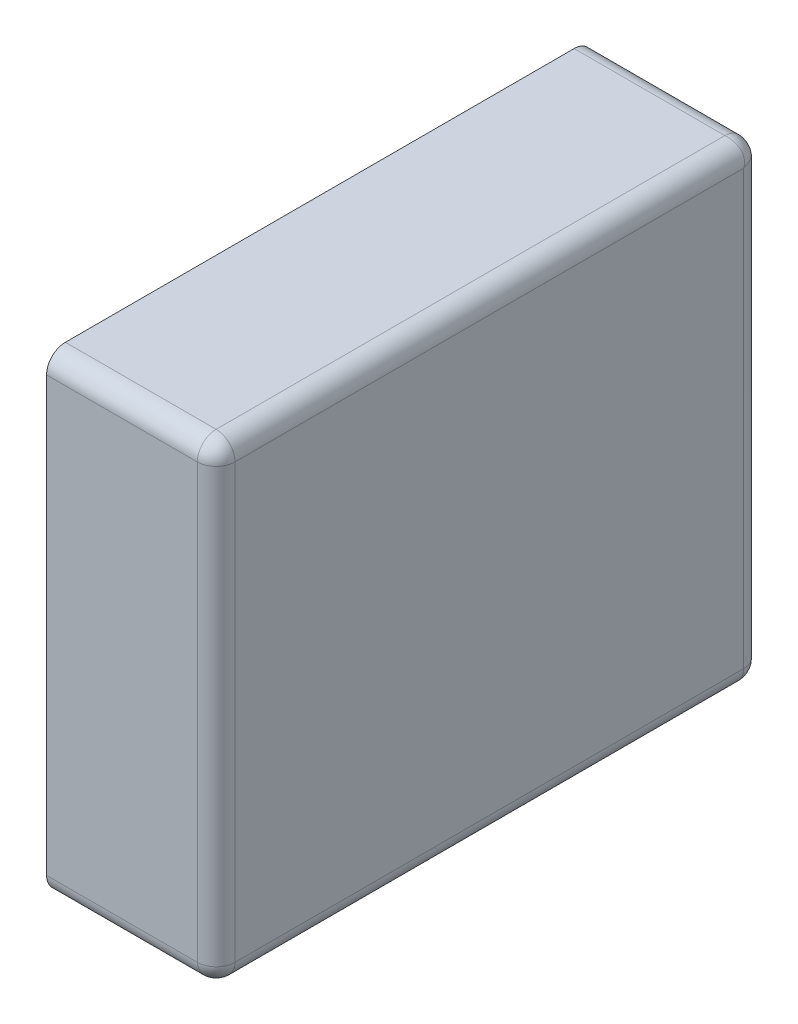
ISO-10303-21;
HEADER;
FILE_DESCRIPTION(('STEP AP214'),'2;1');
FILE_NAME('part.step','',(''),(''),'','','');
FILE_SCHEMA(('AUTOMOTIVE_DESIGN { 1 0 10303 214 1 1 1 1 }'));
ENDSEC;
DATA;
#1=APPLICATION_CONTEXT('core data for automotive mechanical design processes');
#2=APPLICATION_PROTOCOL_DEFINITION('international standard','automotive_design',2000,#1);
#3=PRODUCT_CONTEXT('',#1,'mechanical');
#4=PRODUCT('Part','Part','',(#3));
#5=PRODUCT_RELATED_PRODUCT_CATEGORY('part','',(#4));
#6=PRODUCT_DEFINITION_FORMATION('','',#4);
#7=PRODUCT_DEFINITION_CONTEXT('part definition',#1,'design');
#8=PRODUCT_DEFINITION('design','',#6,#7);
#9=PRODUCT_DEFINITION_SHAPE('','',#8);
#10=(LENGTH_UNIT() NAMED_UNIT(*) SI_UNIT(.MILLI.,.METRE.));
#11=(NAMED_UNIT(*) PLANE_ANGLE_UNIT() SI_UNIT($,.RADIAN.));
#12=(NAMED_UNIT(*) SI_UNIT($,.STERADIAN.) SOLID_ANGLE_UNIT());
#13=UNCERTAINTY_MEASURE_WITH_UNIT(LENGTH_MEASURE(1.E-05),#10,'distance_accuracy_value','');
#14=(GEOMETRIC_REPRESENTATION_CONTEXT(3) GLOBAL_UNCERTAINTY_ASSIGNED_CONTEXT((#13)) GLOBAL_UNIT_ASSIGNED_CONTEXT((#10,
#11,#12)) REPRESENTATION_CONTEXT('',''));
#15=CARTESIAN_POINT('',(0.,0.,0.));
#16=DIRECTION('',(0.,0.,1.));
#17=DIRECTION('',(1.,0.,0.));
#18=AXIS2_PLACEMENT_3D('',#15,#16,#17);
#19=CARTESIAN_POINT('',(0.25,-0.308333310554192,0.05));
#20=DIRECTION('',(-0.408248290463863,-0.816496580927726,0.408248290463863));
#21=DIRECTION('',(0.577350269189626,-0.577350269189626,-0.577350269189626));
#22=AXIS2_PLACEMENT_3D('',#19,#20,#21);
#23=SPHERICAL_SURFACE('',#22,0.05);
#24=CARTESIAN_POINT('',(0.25,-0.308333310554192,0.05));
#25=DIRECTION('',(1.,0.,0.));
#26=DIRECTION('',(0.,0.,-1.));
#27=AXIS2_PLACEMENT_3D('',#24,#25,#26);
#28=CIRCLE('',#27,0.05);
#29=CARTESIAN_POINT('',(0.25,-0.358333310554192,0.05));
#30=VERTEX_POINT('',#29);
#31=CARTESIAN_POINT('',(0.25,-0.308333310554192,0.));
#32=VERTEX_POINT('',#31);
#33=EDGE_CURVE('E11',#30,#32,#28,.T.);
#34=ORIENTED_EDGE('',*,*,#33,.T.);
#35=CARTESIAN_POINT('',(0.25,-0.308333310554192,0.05));
#36=DIRECTION('',(0.,-1.,0.));
#37=DIRECTION('',(1.,0.,0.));
#38=AXIS2_PLACEMENT_3D('',#35,#36,#37);
#39=CIRCLE('',#38,0.05);
#40=CARTESIAN_POINT('',(0.3,-0.308333310554192,0.05));
#41=VERTEX_POINT('',#40);
#42=EDGE_CURVE('E24',#32,#41,#39,.T.);
#43=ORIENTED_EDGE('',*,*,#42,.T.);
#44=CARTESIAN_POINT('',(0.25,-0.308333310554192,0.05));
#45=DIRECTION('',(0.,0.,-1.));
#46=DIRECTION('',(0.,-1.,0.));
#47=AXIS2_PLACEMENT_3D('',#44,#45,#46);
#48=CIRCLE('',#47,0.05);
#49=EDGE_CURVE('E287',#41,#30,#48,.T.);
#50=ORIENTED_EDGE('',*,*,#49,.T.);
#51=EDGE_LOOP('',(#34,#43,#50));
#52=FACE_BOUND('',#51,.T.);
#53=ADVANCED_FACE('F17',(#52),#23,.T.);
#54=CARTESIAN_POINT('',(0.25,-0.308333310554192,1.4));
#55=DIRECTION('',(-0.408248290463862,-0.816496580927726,-0.408248290463864));
#56=DIRECTION('',(0.577350269189625,-0.577350269189626,0.577350269189627));
#57=AXIS2_PLACEMENT_3D('',#54,#55,#56);
#58=SPHERICAL_SURFACE('',#57,0.05);
#59=CARTESIAN_POINT('',(0.25,-0.308333310554192,1.45));
#60=CARTESIAN_POINT('',(0.250056476640882,-0.309164662981859,1.45000002031397));
#61=CARTESIAN_POINT('',(0.250121168311557,-0.30999542167902,1.44997917131755));
#62=CARTESIAN_POINT('',(0.250265391195623,-0.311657334802944,1.44989569556504));
#63=CARTESIAN_POINT('',(0.250344988001439,-0.31248847412573,1.44983288086806));
#64=CARTESIAN_POINT('',(0.250517234671643,-0.314148546660269,1.44966509757926));
#65=CARTESIAN_POINT('',(0.250609936033336,-0.314977457349145,1.44955995950256));
#66=CARTESIAN_POINT('',(0.250806520816706,-0.316630527199554,1.44930737239836));
#67=CARTESIAN_POINT('',(0.25091044290025,-0.317454658911413,1.44915977396341));
#68=CARTESIAN_POINT('',(0.251127528752862,-0.319095657803344,1.44882229239235));
#69=CARTESIAN_POINT('',(0.251240719867609,-0.319912494981017,1.44863228105857));
#70=CARTESIAN_POINT('',(0.251474344176626,-0.321536442570935,1.44821019528102));
#71=CARTESIAN_POINT('',(0.251594795122853,-0.322343522825329,1.44797801468437));
#72=CARTESIAN_POINT('',(0.251840892195576,-0.323945551721639,1.44747200526275));
#73=CARTESIAN_POINT('',(0.251966548375925,-0.324740472397371,1.44719809281404));
#74=CARTESIAN_POINT('',(0.252220973549074,-0.32631584408808,1.44660922840147));
#75=CARTESIAN_POINT('',(0.252349746928956,-0.327096271606362,1.44629421548598));
#76=CARTESIAN_POINT('',(0.252608300810853,-0.328640393971993,1.44562395131688));
#77=CARTESIAN_POINT('',(0.252738082163722,-0.329404071972065,1.44526866158421));
#78=CARTESIAN_POINT('',(0.252996535248399,-0.330912515415975,1.44451883535746));
#79=CARTESIAN_POINT('',(0.253125206487437,-0.331657272720296,1.44412428231988));
#80=CARTESIAN_POINT('',(0.253379323912972,-0.333125785626233,1.44329710837936));
#81=CARTESIAN_POINT('',(0.253504770480528,-0.333849543710642,1.44286449200134));
#82=CARTESIAN_POINT('',(0.253750336828149,-0.335274066953656,1.44196255359726));
#83=CARTESIAN_POINT('',(0.253870460068205,-0.335974846967864,1.44149325597784));
#84=CARTESIAN_POINT('',(0.254103304064891,-0.337351527474695,1.44051949570568));
#85=CARTESIAN_POINT('',(0.254216033516177,-0.338027456763577,1.44001507584848));
#86=CARTESIAN_POINT('',(0.254432052512974,-0.33935266005221,1.43897278428959));
#87=CARTESIAN_POINT('',(0.254535358057478,-0.340001978156978,1.43843497199004));
#88=CARTESIAN_POINT('',(0.254730542154479,-0.341272299809228,1.43732777460933));
#89=CARTESIAN_POINT('',(0.254822445957708,-0.341893363923171,1.43675846348493));
#90=CARTESIAN_POINT('',(0.254992901649071,-0.343105639944394,1.43559030584348));
#91=CARTESIAN_POINT('',(0.255071489829275,-0.343696929802492,1.43499154553938));
#92=CARTESIAN_POINT('',(0.255213463043959,-0.344848245829343,1.43376667689025));
#93=CARTESIAN_POINT('',(0.255276897009026,-0.345408368013381,1.43314066449634));
#94=CARTESIAN_POINT('',(0.255386795425953,-0.346496067335968,1.43186361983902));
#95=CARTESIAN_POINT('',(0.255433322818258,-0.347023758979868,1.43121269055809));
#96=CARTESIAN_POINT('',(0.255507737338678,-0.348045449350346,1.42988827123633));
#97=CARTESIAN_POINT('',(0.25553570253075,-0.348539581233155,1.42921488834858));
#98=CARTESIAN_POINT('',(0.255571427793508,-0.349493140439531,1.42784814127885));
#99=CARTESIAN_POINT('',(0.255579281877824,-0.349952719457549,1.42715488544524));
#100=CARTESIAN_POINT('',(0.255573335713261,-0.350836299644668,1.42575108108726));
#101=CARTESIAN_POINT('',(0.255559645939103,-0.351260470653455,1.42504063906048));
#102=CARTESIAN_POINT('',(0.255509287643763,-0.352072501389798,1.42360524818424));
#103=CARTESIAN_POINT('',(0.255472746231199,-0.352460548424196,1.42288040091383));
#104=CARTESIAN_POINT('',(0.255375493621831,-0.353199738480209,1.42141907045753));
#105=CARTESIAN_POINT('',(0.255314925981525,-0.35355108531067,1.42068268089524));
#106=CARTESIAN_POINT('',(0.255168570932992,-0.354216423264989,1.41920120834795));
#107=CARTESIAN_POINT('',(0.255082942970717,-0.354530633447628,1.41845620808787));
#108=CARTESIAN_POINT('',(0.254885566112575,-0.355121386709123,1.41696051703845));
#109=CARTESIAN_POINT('',(0.254773991607376,-0.355398162565069,1.41620989527186));
#110=CARTESIAN_POINT('',(0.254523973299393,-0.355913876381134,1.41470600292695));
#111=CARTESIAN_POINT('',(0.254385717519098,-0.356153059023342,1.4139527851382));
#112=CARTESIAN_POINT('',(0.254081755398417,-0.356593549745939,1.41244679638543));
#113=CARTESIAN_POINT('',(0.253916248962334,-0.356795112374401,1.41169405953744));
#114=CARTESIAN_POINT('',(0.253557343726359,-0.357160476248509,1.41019206042752));
#115=CARTESIAN_POINT('',(0.253364154831346,-0.357324539502694,1.40944281229227));
#116=CARTESIAN_POINT('',(0.253052732369609,-0.357542869289562,1.4083219455075));
#117=CARTESIAN_POINT('',(0.252945638881777,-0.357610870709135,1.40794983260432));
#118=CARTESIAN_POINT('',(0.252724431166697,-0.357737569445092,1.40720763742837));
#119=CARTESIAN_POINT('',(0.252610344441124,-0.357796300321971,1.40683755274195));
#120=CARTESIAN_POINT('',(0.252375149481327,-0.35790450391496,1.40609981269566));
#121=CARTESIAN_POINT('',(0.252254068989278,-0.357954010307306,1.40573215342186));
#122=CARTESIAN_POINT('',(0.25200489200401,-0.358043823540288,1.40499964182244));
#123=CARTESIAN_POINT('',(0.251876823418455,-0.358084164066007,1.40463478414168));
#124=CARTESIAN_POINT('',(0.25161368768569,-0.358155710450416,1.4039082563057));
#125=CARTESIAN_POINT('',(0.251478648512781,-0.358186949917715,1.40354657933213));
#126=CARTESIAN_POINT('',(0.251201599789781,-0.358240367053443,1.40282678964261));
#127=CARTESIAN_POINT('',(0.251059618183824,-0.358262578160602,1.40246866865684));
#128=CARTESIAN_POINT('',(0.250768722771826,-0.358298018075102,1.40175636445159));
#129=CARTESIAN_POINT('',(0.250619836783965,-0.35831128006162,1.40140217152902));
#130=CARTESIAN_POINT('',(0.250315184973883,-0.35832891062971,1.40069809533217));
#131=CARTESIAN_POINT('',(0.25015944673132,-0.358333312030094,1.40034820094293));
#132=CARTESIAN_POINT('',(0.25,-0.358333310554192,1.4));
#133=B_SPLINE_CURVE_WITH_KNOTS('',3,(#59,#60,#61,#62,#63,#64,#65,#66,#67,#68,#69,#70,#71,#72,
#73,#74,#75,#76,#77,#78,#79,#80,#81,#82,#83,#84,#85,#86,#87,#88,#89,#90,#91,#92,#93,#94,#95,#96,
#97,#98,#99,#100,#101,#102,#103,#104,#105,#106,#107,#108,#109,#110,#111,#112,#113,#114,#115,
#116,#117,#118,#119,#120,#121,#122,#123,#124,#125,#126,#127,#128,#129,#130,#131,#132),
.UNSPECIFIED.,.F.,.F.,(4,2,2,2,2,2,2,2,2,2,2,2,2,2,2,2,2,2,2,2,2,2,2,2,2,2,2,2,2,2,2,2,2,2,2,2,
4),(0.,0.00249945349828853,0.00501017636236172,0.00753105510997409,0.0100609150362242,
0.0125985278601288,0.015142619470862,0.017691877752768,0.020244960471291,0.0228005032044077,
0.025357127306039,0.0279134478892866,0.030468081818201,0.0330196556971654,0.0355668138468769,
0.0381082262553105,0.0406425964909796,0.0431686695642027,0.0456852397199663,0.048191158143267,
0.0506853405545279,0.0531667746687543,0.0556345274875088,0.0580877523875284,0.0605256959638786,
0.0629477045789644,0.0653532305615734,0.0677418379925144,0.0701132080055178,0.0712924926926686,
0.0724674051483097,0.0736379404537152,0.0748041017706805,0.0759659004268235,0.0771233559869032,
0.0782764963093342,0.0794253575870824),.UNSPECIFIED.);
#134=CARTESIAN_POINT('',(0.25,-0.308333310554192,1.45));
#135=VERTEX_POINT('',#134);
#136=CARTESIAN_POINT('',(0.25,-0.358333310554192,1.4));
#137=VERTEX_POINT('',#136);
#138=EDGE_CURVE('E285',#135,#137,#133,.T.);
#139=ORIENTED_EDGE('',*,*,#138,.T.);
#140=CARTESIAN_POINT('',(0.25,-0.308333310554192,1.4));
#141=DIRECTION('',(0.,0.,1.));
#142=DIRECTION('',(1.,0.,0.));
#143=AXIS2_PLACEMENT_3D('',#140,#141,#142);
#144=CIRCLE('',#143,0.05);
#145=CARTESIAN_POINT('',(0.3,-0.308333310554192,1.4));
#146=VERTEX_POINT('',#145);
#147=EDGE_CURVE('E321',#137,#146,#144,.T.);
#148=ORIENTED_EDGE('',*,*,#147,.T.);
#149=CARTESIAN_POINT('',(0.25,-0.308333310554192,1.4));
#150=DIRECTION('',(0.,-1.,0.));
#151=DIRECTION('',(0.,0.,1.));
#152=AXIS2_PLACEMENT_3D('',#149,#150,#151);
#153=CIRCLE('',#152,0.05);
#154=EDGE_CURVE('E319',#146,#135,#153,.T.);
#155=ORIENTED_EDGE('',*,*,#154,.T.);
#156=EDGE_LOOP('',(#139,#148,#155));
#157=FACE_BOUND('',#156,.T.);
#158=ADVANCED_FACE('F262',(#157),#58,.T.);
#159=CARTESIAN_POINT('',(0.25,-0.308333310554192,0.));
#160=DIRECTION('',(0.,0.,1.));
#161=DIRECTION('',(0.707106781186548,-0.707106781186547,0.));
#162=AXIS2_PLACEMENT_3D('',#159,#160,#161);
#163=CYLINDRICAL_SURFACE('',#162,0.05);
#164=ORIENTED_EDGE('',*,*,#147,.F.);
#165=DIRECTION('',(0.,0.,-1.));
#166=VECTOR('',#165,1.);
#167=CARTESIAN_POINT('',(0.25,-0.358333310554192,0.));
#168=LINE('',#167,#166);
#169=EDGE_CURVE('E295',#137,#30,#168,.T.);
#170=ORIENTED_EDGE('',*,*,#169,.T.);
#171=ORIENTED_EDGE('',*,*,#49,.F.);
#172=DIRECTION('',(0.,0.,1.));
#173=VECTOR('',#172,1.);
#174=CARTESIAN_POINT('',(0.3,-0.308333310554192,0.));
#175=LINE('',#174,#173);
#176=EDGE_CURVE('E293',#41,#146,#175,.T.);
#177=ORIENTED_EDGE('',*,*,#176,.T.);
#178=EDGE_LOOP('',(#164,#170,#171,#177));
#179=FACE_BOUND('',#178,.T.);
#180=ADVANCED_FACE('F214',(#179),#163,.T.);
#181=CARTESIAN_POINT('',(0.25,0.841666689445808,0.05));
#182=DIRECTION('',(-0.816496580927726,0.408248290463864,-0.408248290463863));
#183=DIRECTION('',(0.577350269189626,0.577350269189626,-0.577350269189625));
#184=AXIS2_PLACEMENT_3D('',#181,#182,#183);
#185=SPHERICAL_SURFACE('',#184,0.05);
#186=CARTESIAN_POINT('',(0.3,0.841666689445808,0.05));
#187=CARTESIAN_POINT('',(0.300000001475902,0.841826136177128,0.0496517990570679));
#188=CARTESIAN_POINT('',(0.299995600075518,0.841981874419691,0.0493019046678338));
#189=CARTESIAN_POINT('',(0.299977969507428,0.842286526229773,0.048597828470979));
#190=CARTESIAN_POINT('',(0.29996470752091,0.842435412217634,0.0482436355484064));
#191=CARTESIAN_POINT('',(0.29992926760641,0.842726307629632,0.0475313313431616));
#192=CARTESIAN_POINT('',(0.299907056499251,0.842868289235589,0.04717321035739));
#193=CARTESIAN_POINT('',(0.299853639363523,0.843145337958589,0.0464534206678749));
#194=CARTESIAN_POINT('',(0.299822399896224,0.843280377131498,0.0460917436943033));
#195=CARTESIAN_POINT('',(0.299750853511815,0.843543512864263,0.0453652158583165));
#196=CARTESIAN_POINT('',(0.299710512986096,0.843671581449818,0.0450003581775609));
#197=CARTESIAN_POINT('',(0.299620699753114,0.843920758435086,0.0442678465781355));
#198=CARTESIAN_POINT('',(0.299571193360768,0.844041838927135,0.0439001873043394));
#199=CARTESIAN_POINT('',(0.299462989767779,0.844277033886932,0.0431624472580473));
#200=CARTESIAN_POINT('',(0.2994042588909,0.844391120612505,0.0427923625716342));
#201=CARTESIAN_POINT('',(0.299277560154943,0.844612328327585,0.0420501673956815));
#202=CARTESIAN_POINT('',(0.29920955873537,0.844719421815417,0.0416780544924992));
#203=CARTESIAN_POINT('',(0.298991228948502,0.845030844277154,0.0405571877077269));
#204=CARTESIAN_POINT('',(0.298827165694317,0.845224033172167,0.0398079395724777));
#205=CARTESIAN_POINT('',(0.298461801820209,0.845582938408142,0.0383059404625556));
#206=CARTESIAN_POINT('',(0.298260239191747,0.845748444844225,0.037553203614566));
#207=CARTESIAN_POINT('',(0.29781974846915,0.846052406964906,0.0360472148618045));
#208=CARTESIAN_POINT('',(0.297580565826942,0.846190662745201,0.0352939970730491));
#209=CARTESIAN_POINT('',(0.297064852010877,0.846440681053184,0.0337901047281378));
#210=CARTESIAN_POINT('',(0.296788076154931,0.846552255558383,0.0330394829615458));
#211=CARTESIAN_POINT('',(0.296197322893436,0.846749632416525,0.0315437919121317));
#212=CARTESIAN_POINT('',(0.295883112710797,0.8468352603788,0.0307987916520525));
#213=CARTESIAN_POINT('',(0.295217774756478,0.846981615427334,0.0293173191047622));
#214=CARTESIAN_POINT('',(0.294866427926017,0.847042183067639,0.0285809295424739));
#215=CARTESIAN_POINT('',(0.294127237870004,0.847139435677007,0.0271195990861678));
#216=CARTESIAN_POINT('',(0.293739190835606,0.847175977089571,0.0263947518157568));
#217=CARTESIAN_POINT('',(0.292927160099263,0.847226335384911,0.0249593609395231));
#218=CARTESIAN_POINT('',(0.292502989090476,0.847240025159069,0.0242489189127446));
#219=CARTESIAN_POINT('',(0.291619408903357,0.847245971323631,0.022845114554765));
#220=CARTESIAN_POINT('',(0.291159829885339,0.847238117239316,0.0221518587211452));
#221=CARTESIAN_POINT('',(0.290206270678963,0.847202391976558,0.0207851116514152));
#222=CARTESIAN_POINT('',(0.289712138796154,0.847174426784487,0.0201117287636731));
#223=CARTESIAN_POINT('',(0.288690448425676,0.847100012264066,0.018787309441907));
#224=CARTESIAN_POINT('',(0.288162756781776,0.847053484871761,0.0181363801609791));
#225=CARTESIAN_POINT('',(0.287075057459189,0.846943586454834,0.0168593355036592));
#226=CARTESIAN_POINT('',(0.286514935275151,0.846880152489767,0.0162333231097527));
#227=CARTESIAN_POINT('',(0.2853636192483,0.846738179275083,0.0150084544606196));
#228=CARTESIAN_POINT('',(0.284772329390202,0.846659591094879,0.0144096941565242));
#229=CARTESIAN_POINT('',(0.283560053368979,0.846489135403516,0.0132415365150735));
#230=CARTESIAN_POINT('',(0.282938989255036,0.846397231600287,0.0126722253906709));
#231=CARTESIAN_POINT('',(0.281668667602786,0.846202047503286,0.0115650280099562));
#232=CARTESIAN_POINT('',(0.281019349498018,0.846098741958783,0.0110272157104117));
#233=CARTESIAN_POINT('',(0.279694146209385,0.845882722961985,0.00998492415151916));
#234=CARTESIAN_POINT('',(0.279018216920503,0.845769993510699,0.00948050429432074));
#235=CARTESIAN_POINT('',(0.277641536413672,0.845537149514013,0.00850674402215685));
#236=CARTESIAN_POINT('',(0.276940756399464,0.845417026273957,0.00803744640273572));
#237=CARTESIAN_POINT('',(0.27551623315645,0.845171459926336,0.00713550799866328));
#238=CARTESIAN_POINT('',(0.274792475072041,0.84504601335878,0.00670289162064473));
#239=CARTESIAN_POINT('',(0.273323962166104,0.844791895933245,0.0058757176801218));
#240=CARTESIAN_POINT('',(0.272579204861783,0.844663224694207,0.00548116464253525));
#241=CARTESIAN_POINT('',(0.271070761417873,0.84440477160953,0.00473133841578786));
#242=CARTESIAN_POINT('',(0.270307083417801,0.844274990256661,0.0043760486831198));
#243=CARTESIAN_POINT('',(0.26876296105217,0.844016436374764,0.00370578451402039));
#244=CARTESIAN_POINT('',(0.267982533533888,0.843887662994882,0.00339077159853355));
#245=CARTESIAN_POINT('',(0.266407161843179,0.843633237821733,0.00280190718596448));
#246=CARTESIAN_POINT('',(0.265612241167447,0.843507581641384,0.00252799473724833));
#247=CARTESIAN_POINT('',(0.264010212271137,0.843261484568661,0.00202198531563092));
#248=CARTESIAN_POINT('',(0.263203132016743,0.843141033622434,0.00178980471897604));
#249=CARTESIAN_POINT('',(0.261579184426824,0.842907409313417,0.00136771894143312));
#250=CARTESIAN_POINT('',(0.260762347249152,0.84279421819867,0.00117770760765169));
#251=CARTESIAN_POINT('',(0.259121348357221,0.842577132346058,0.000840226036591075));
#252=CARTESIAN_POINT('',(0.258297216645363,0.842473210262514,0.000692627601644528));
#253=CARTESIAN_POINT('',(0.256644146794953,0.842276625479144,0.000440040497442487));
#254=CARTESIAN_POINT('',(0.255815236106077,0.842183924117451,0.000334902420738301));
#255=CARTESIAN_POINT('',(0.254155163571538,0.842011677447247,0.000167119131942064));
#256=CARTESIAN_POINT('',(0.253324024248752,0.841932080641431,0.000104304434962564));
#257=CARTESIAN_POINT('',(0.251662111124828,0.841787857757365,2.08286824513665E-05));
#258=CARTESIAN_POINT('',(0.250831352427667,0.84172316608669,-2.0313966927504E-08));
#259=CARTESIAN_POINT('',(0.25,0.841666689445808,0.));
#260=B_SPLINE_CURVE_WITH_KNOTS('',3,(#186,#187,#188,#189,#190,#191,#192,#193,#194,#195,#196,
#197,#198,#199,#200,#201,#202,#203,#204,#205,#206,#207,#208,#209,#210,#211,#212,#213,#214,#215,
#216,#217,#218,#219,#220,#221,#222,#223,#224,#225,#226,#227,#228,#229,#230,#231,#232,#233,#234,
#235,#236,#237,#238,#239,#240,#241,#242,#243,#244,#245,#246,#247,#248,#249,#250,#251,#252,#253,
#254,#255,#256,#257,#258,#259),.UNSPECIFIED.,.F.,.F.,(4,2,2,2,2,2,2,2,2,2,2,2,2,2,2,2,2,2,2,2,2,
2,2,2,2,2,2,2,2,2,2,2,2,2,2,2,4),(0.,0.00114886127774819,0.00230200160017933,
0.00345945716025893,0.00462125581640201,0.00578741713336717,0.00695795243877276,
0.00813286489441385,0.00931214958156474,0.0116835195945681,0.0140721270255091,
0.0164776530081181,0.0188996616232039,0.021337605199554,0.0237908300995737,0.0262585829183281,
0.0287400170325546,0.0312341994438155,0.0337401178671161,0.0362566880228797,0.0387827610961029,
0.0413171313317719,0.0438585437402056,0.046405701889917,0.0489572757688815,0.0515119096977957,
0.0540682302810433,0.0566248543826747,0.0591803971157914,0.0617334798343145,0.0642827381162205,
0.0668268297269537,0.0693644425508582,0.0718943024771082,0.0744151812247206,0.0769259040887938,
0.0794253575870824),.UNSPECIFIED.);
#261=CARTESIAN_POINT('',(0.3,0.841666689445808,0.05));
#262=VERTEX_POINT('',#261);
#263=CARTESIAN_POINT('',(0.25,0.841666689445808,0.));
#264=VERTEX_POINT('',#263);
#265=EDGE_CURVE('E236',#262,#264,#260,.T.);
#266=ORIENTED_EDGE('',*,*,#265,.T.);
#267=CARTESIAN_POINT('',(0.25,0.841666689445808,0.05));
#268=DIRECTION('',(1.,0.,0.));
#269=DIRECTION('',(0.,1.,0.));
#270=AXIS2_PLACEMENT_3D('',#267,#268,#269);
#271=CIRCLE('',#270,0.05);
#272=CARTESIAN_POINT('',(0.25,0.891666689445808,0.05));
#273=VERTEX_POINT('',#272);
#274=EDGE_CURVE('E234',#264,#273,#271,.T.);
#275=ORIENTED_EDGE('',*,*,#274,.T.);
#276=CARTESIAN_POINT('',(0.25,0.891666689445808,0.05));
#277=CARTESIAN_POINT('',(0.250831352427667,0.891666709759775,0.0499435233591183));
#278=CARTESIAN_POINT('',(0.251662111124828,0.891645860763357,0.0498788316884433));
#279=CARTESIAN_POINT('',(0.253324024248752,0.891562385010845,0.049734608804377));
#280=CARTESIAN_POINT('',(0.254155163571538,0.891499570313866,0.0496550119985609));
#281=CARTESIAN_POINT('',(0.255815236106077,0.89133178702507,0.0494827653283566));
#282=CARTESIAN_POINT('',(0.256644146794953,0.891226648948365,0.0493900639666642));
#283=CARTESIAN_POINT('',(0.258297216645363,0.890974061844164,0.0491934791832936));
#284=CARTESIAN_POINT('',(0.259121348357221,0.890826463409217,0.0490895570997497));
#285=CARTESIAN_POINT('',(0.260762347249152,0.890488981838156,0.0488724712471381));
#286=CARTESIAN_POINT('',(0.261579184426824,0.890298970504375,0.0487592801323913));
#287=CARTESIAN_POINT('',(0.263203132016743,0.889876884726832,0.0485256558233742));
#288=CARTESIAN_POINT('',(0.264010212271137,0.889644704130177,0.0484052048771467));
#289=CARTESIAN_POINT('',(0.265612241167447,0.88913869470856,0.0481591078044245));
#290=CARTESIAN_POINT('',(0.266407161843179,0.888864782259843,0.0480334516240748));
#291=CARTESIAN_POINT('',(0.267982533533888,0.888275917847274,0.0477790264509255));
#292=CARTESIAN_POINT('',(0.26876296105217,0.887960904931788,0.0476502530710441));
#293=CARTESIAN_POINT('',(0.270307083417801,0.887290640762688,0.0473916991891467));
#294=CARTESIAN_POINT('',(0.271070761417873,0.88693535103002,0.0472619178362776));
#295=CARTESIAN_POINT('',(0.272579204861783,0.886185524803273,0.0470034647516007));
#296=CARTESIAN_POINT('',(0.273323962166104,0.885790971765686,0.0468747935125628));
#297=CARTESIAN_POINT('',(0.274792475072041,0.884963797825163,0.0466206760870283));
#298=CARTESIAN_POINT('',(0.27551623315645,0.884531181447145,0.046495229519472));
#299=CARTESIAN_POINT('',(0.276940756399464,0.883629243043072,0.0462496631718509));
#300=CARTESIAN_POINT('',(0.277641536413672,0.883159945423651,0.0461295399317952));
#301=CARTESIAN_POINT('',(0.279018216920503,0.882186185151487,0.045896695935109));
#302=CARTESIAN_POINT('',(0.279694146209385,0.881681765294289,0.0457839664838229));
#303=CARTESIAN_POINT('',(0.281019349498018,0.880639473735396,0.0455679474870255));
#304=CARTESIAN_POINT('',(0.281668667602786,0.880101661435852,0.0454646419425221));
#305=CARTESIAN_POINT('',(0.282938989255036,0.878994464055137,0.0452694578455207));
#306=CARTESIAN_POINT('',(0.283560053368979,0.878425152930734,0.0451775540422924));
#307=CARTESIAN_POINT('',(0.284772329390202,0.877256995289284,0.0450070983509292));
#308=CARTESIAN_POINT('',(0.2853636192483,0.876658234985188,0.044928510170725));
#309=CARTESIAN_POINT('',(0.286514935275151,0.875433366336055,0.0447865369560409));
#310=CARTESIAN_POINT('',(0.287075057459189,0.874807353942149,0.0447231029909742));
#311=CARTESIAN_POINT('',(0.288162756781776,0.873530309284829,0.0446132045740466));
#312=CARTESIAN_POINT('',(0.288690448425676,0.872879380003901,0.0445666771817417));
#313=CARTESIAN_POINT('',(0.289712138796154,0.871554960682135,0.0444922626613215));
#314=CARTESIAN_POINT('',(0.290206270678963,0.870881577794393,0.04446429746925));
#315=CARTESIAN_POINT('',(0.291159829885339,0.869514830724663,0.0444285722064917));
#316=CARTESIAN_POINT('',(0.291619408903357,0.868821574891043,0.0444207181221764));
#317=CARTESIAN_POINT('',(0.292502989090476,0.867417770533063,0.0444266642867391));
#318=CARTESIAN_POINT('',(0.292927160099263,0.866707328506285,0.0444403540608965));
#319=CARTESIAN_POINT('',(0.293739190835606,0.865271937630051,0.0444907123562374));
#320=CARTESIAN_POINT('',(0.294127237870004,0.86454709035964,0.0445272537688012));
#321=CARTESIAN_POINT('',(0.294866427926017,0.863085759903334,0.0446245063781687));
#322=CARTESIAN_POINT('',(0.295217774756478,0.862349370341046,0.0446850740184745));
#323=CARTESIAN_POINT('',(0.295883112710797,0.860867897793755,0.0448314290670078));
#324=CARTESIAN_POINT('',(0.296197322893436,0.860122897533676,0.044917057029283));
#325=CARTESIAN_POINT('',(0.296788076154931,0.858627206484262,0.0451144338874251));
#326=CARTESIAN_POINT('',(0.297064852010877,0.85787658471767,0.0452260083926239));
#327=CARTESIAN_POINT('',(0.297580565826942,0.856372692372759,0.0454760267006073));
#328=CARTESIAN_POINT('',(0.29781974846915,0.855619474584003,0.0456142824809019));
#329=CARTESIAN_POINT('',(0.298260239191747,0.854113485831242,0.0459182446015832));
#330=CARTESIAN_POINT('',(0.298461801820209,0.853360748983252,0.0460837510376664));
#331=CARTESIAN_POINT('',(0.298827165694317,0.85185874987333,0.0464426562736406));
#332=CARTESIAN_POINT('',(0.298991228948502,0.851109501738081,0.0466358451686541));
#333=CARTESIAN_POINT('',(0.29920955873537,0.849988634953309,0.0469472676303908));
#334=CARTESIAN_POINT('',(0.299277560154943,0.849616522050126,0.0470543611182233));
#335=CARTESIAN_POINT('',(0.2994042588909,0.848874326874174,0.0472755688333027));
#336=CARTESIAN_POINT('',(0.299462989767779,0.848504242187761,0.0473896555588764));
#337=CARTESIAN_POINT('',(0.299571193360768,0.847766502141469,0.0476248505186726));
#338=CARTESIAN_POINT('',(0.299620699753114,0.847398842867673,0.047745931010722));
#339=CARTESIAN_POINT('',(0.299710512986096,0.846666331268247,0.0479951079959895));
#340=CARTESIAN_POINT('',(0.299750853511815,0.846301473587492,0.0481231765815452));
#341=CARTESIAN_POINT('',(0.299822399896224,0.845574945751505,0.0483863123143096));
#342=CARTESIAN_POINT('',(0.299853639363523,0.845213268777933,0.0485213514872187));
#343=CARTESIAN_POINT('',(0.299907056499251,0.844493479088418,0.0487984002102193));
#344=CARTESIAN_POINT('',(0.29992926760641,0.844135358102647,0.0489403818161762));
#345=CARTESIAN_POINT('',(0.29996470752091,0.843423053897402,0.0492312772281743));
#346=CARTESIAN_POINT('',(0.299977969507428,0.843068860974829,0.0493801632160355));
#347=CARTESIAN_POINT('',(0.299995600075518,0.842364784777974,0.0496848150261171));
#348=CARTESIAN_POINT('',(0.300000001475902,0.84201489038874,0.0498405532686796));
#349=CARTESIAN_POINT('',(0.3,0.841666689445808,0.05));
#350=B_SPLINE_CURVE_WITH_KNOTS('',3,(#276,#277,#278,#279,#280,#281,#282,#283,#284,#285,#286,
#287,#288,#289,#290,#291,#292,#293,#294,#295,#296,#297,#298,#299,#300,#301,#302,#303,#304,#305,
#306,#307,#308,#309,#310,#311,#312,#313,#314,#315,#316,#317,#318,#319,#320,#321,#322,#323,#324,
#325,#326,#327,#328,#329,#330,#331,#332,#333,#334,#335,#336,#337,#338,#339,#340,#341,#342,#343,
#344,#345,#346,#347,#348,#349),.UNSPECIFIED.,.F.,.F.,(4,2,2,2,2,2,2,2,2,2,2,2,2,2,2,2,2,2,2,2,2,
2,2,2,2,2,2,2,2,2,2,2,2,2,2,2,4),(0.,0.00249945349828853,0.00501017636236174,
0.00753105510997416,0.0100609150362242,0.0125985278601288,0.015142619470862,0.017691877752768,
0.020244960471291,0.0228005032044077,0.025357127306039,0.0279134478892867,0.0304680818182009,
0.0330196556971655,0.0355668138468769,0.0381082262553106,0.0406425964909796,0.0431686695642028,
0.0456852397199664,0.048191158143267,0.0506853405545279,0.0531667746687543,0.0556345274875087,
0.0580877523875283,0.0605256959638785,0.0629477045789643,0.0653532305615734,0.0677418379925143,
0.0701132080055177,0.0712924926926686,0.0724674051483096,0.0736379404537152,0.0748041017706804,
0.0759659004268235,0.077123355986903,0.0782764963093342,0.0794253575870824),.UNSPECIFIED.);
#351=EDGE_CURVE('E182',#273,#262,#350,.T.);
#352=ORIENTED_EDGE('',*,*,#351,.T.);
#353=EDGE_LOOP('',(#266,#275,#352));
#354=FACE_BOUND('',#353,.T.);
#355=ADVANCED_FACE('F209',(#354),#185,.T.);
#356=CARTESIAN_POINT('',(0.1875,0.841666689445808,0.05));
#357=DIRECTION('',(1.,0.,0.));
#358=DIRECTION('',(0.,0.707106781186548,-0.707106781186547));
#359=AXIS2_PLACEMENT_3D('',#356,#357,#358);
#360=CYLINDRICAL_SURFACE('',#359,0.05);
#361=CARTESIAN_POINT('',(-0.15,0.841666689445808,0.05));
#362=DIRECTION('',(1.,0.,0.));
#363=DIRECTION('',(0.,0.707106781186548,-0.707106781186547));
#364=AXIS2_PLACEMENT_3D('',#361,#362,#363);
#365=CIRCLE('',#364,0.05);
#366=CARTESIAN_POINT('',(-0.15,0.841666689445808,0.));
#367=VERTEX_POINT('',#366);
#368=CARTESIAN_POINT('',(-0.15,0.891666689445808,0.05));
#369=VERTEX_POINT('',#368);
#370=EDGE_CURVE('E180',#367,#369,#365,.T.);
#371=ORIENTED_EDGE('',*,*,#370,.T.);
#372=DIRECTION('',(1.,0.,0.));
#373=VECTOR('',#372,1.);
#374=CARTESIAN_POINT('',(0.1875,0.891666689445808,0.05));
#375=LINE('',#374,#373);
#376=EDGE_CURVE('E175',#369,#273,#375,.T.);
#377=ORIENTED_EDGE('',*,*,#376,.T.);
#378=ORIENTED_EDGE('',*,*,#274,.F.);
#379=DIRECTION('',(-1.,0.,0.));
#380=VECTOR('',#379,1.);
#381=CARTESIAN_POINT('',(0.1875,0.841666689445808,0.));
#382=LINE('',#381,#380);
#383=EDGE_CURVE('E170',#264,#367,#382,.T.);
#384=ORIENTED_EDGE('',*,*,#383,.T.);
#385=EDGE_LOOP('',(#371,#377,#378,#384));
#386=FACE_BOUND('',#385,.T.);
#387=ADVANCED_FACE('F205',(#386),#360,.T.);
#388=CARTESIAN_POINT('',(0.25,0.841666689445808,1.4));
#389=DIRECTION('',(0.408248290463863,-0.816496580927725,0.408248290463864));
#390=DIRECTION('',(0.577350269189625,0.577350269189627,0.577350269189626));
#391=AXIS2_PLACEMENT_3D('',#388,#389,#390);
#392=SPHERICAL_SURFACE('',#391,0.05);
#393=CARTESIAN_POINT('',(0.25,0.841666689445808,1.4));
#394=DIRECTION('',(0.,1.,0.));
#395=DIRECTION('',(1.,0.,0.));
#396=AXIS2_PLACEMENT_3D('',#393,#394,#395);
#397=CIRCLE('',#396,0.05);
#398=CARTESIAN_POINT('',(0.25,0.841666689445808,1.45));
#399=VERTEX_POINT('',#398);
#400=CARTESIAN_POINT('',(0.3,0.841666689445808,1.4));
#401=VERTEX_POINT('',#400);
#402=EDGE_CURVE('E168',#399,#401,#397,.T.);
#403=ORIENTED_EDGE('',*,*,#402,.T.);
#404=CARTESIAN_POINT('',(0.25,0.841666689445808,1.4));
#405=DIRECTION('',(0.,0.,1.));
#406=DIRECTION('',(0.,1.,0.));
#407=AXIS2_PLACEMENT_3D('',#404,#405,#406);
#408=CIRCLE('',#407,0.05);
#409=CARTESIAN_POINT('',(0.25,0.891666689445808,1.4));
#410=VERTEX_POINT('',#409);
#411=EDGE_CURVE('E166',#401,#410,#408,.T.);
#412=ORIENTED_EDGE('',*,*,#411,.T.);
#413=CARTESIAN_POINT('',(0.25,0.841666689445808,1.4));
#414=DIRECTION('',(1.,0.,0.));
#415=DIRECTION('',(0.,0.,1.));
#416=AXIS2_PLACEMENT_3D('',#413,#414,#415);
#417=CIRCLE('',#416,0.05);
#418=EDGE_CURVE('E163',#410,#399,#417,.T.);
#419=ORIENTED_EDGE('',*,*,#418,.T.);
#420=EDGE_LOOP('',(#403,#412,#419));
#421=FACE_BOUND('',#420,.T.);
#422=ADVANCED_FACE('F200',(#421),#392,.T.);
#423=CARTESIAN_POINT('',(0.25,0.841666689445808,0.));
#424=DIRECTION('',(0.,0.,1.));
#425=DIRECTION('',(0.707106781186547,0.707106781186548,0.));
#426=AXIS2_PLACEMENT_3D('',#423,#424,#425);
#427=CYLINDRICAL_SURFACE('',#426,0.05);
#428=ORIENTED_EDGE('',*,*,#411,.F.);
#429=DIRECTION('',(0.,0.,-1.));
#430=VECTOR('',#429,1.);
#431=CARTESIAN_POINT('',(0.3,0.841666689445808,0.));
#432=LINE('',#431,#430);
#433=EDGE_CURVE('E158',#401,#262,#432,.T.);
#434=ORIENTED_EDGE('',*,*,#433,.T.);
#435=ORIENTED_EDGE('',*,*,#351,.F.);
#436=DIRECTION('',(0.,0.,1.));
#437=VECTOR('',#436,1.);
#438=CARTESIAN_POINT('',(0.25,0.891666689445808,0.));
#439=LINE('',#438,#437);
#440=EDGE_CURVE('E153',#273,#410,#439,.T.);
#441=ORIENTED_EDGE('',*,*,#440,.T.);
#442=EDGE_LOOP('',(#428,#434,#435,#441));
#443=FACE_BOUND('',#442,.T.);
#444=ADVANCED_FACE('F189',(#443),#427,.T.);
#445=CARTESIAN_POINT('',(0.1875,0.841666689445808,1.4));
#446=DIRECTION('',(-1.,0.,0.));
#447=DIRECTION('',(0.,0.707106781186548,0.707106781186548));
#448=AXIS2_PLACEMENT_3D('',#445,#446,#447);
#449=CYLINDRICAL_SURFACE('',#448,0.05);
#450=CARTESIAN_POINT('',(-0.15,0.841666689445808,1.4));
#451=DIRECTION('',(1.,0.,0.));
#452=DIRECTION('',(0.,0.707106781186548,0.707106781186548));
#453=AXIS2_PLACEMENT_3D('',#450,#451,#452);
#454=CIRCLE('',#453,0.05);
#455=CARTESIAN_POINT('',(-0.15,0.891666689445808,1.4));
#456=VERTEX_POINT('',#455);
#457=CARTESIAN_POINT('',(-0.15,0.841666689445808,1.45));
#458=VERTEX_POINT('',#457);
#459=EDGE_CURVE('E151',#456,#458,#454,.T.);
#460=ORIENTED_EDGE('',*,*,#459,.T.);
#461=DIRECTION('',(1.,0.,0.));
#462=VECTOR('',#461,1.);
#463=CARTESIAN_POINT('',(0.1875,0.841666689445808,1.45));
#464=LINE('',#463,#462);
#465=EDGE_CURVE('E148',#458,#399,#464,.T.);
#466=ORIENTED_EDGE('',*,*,#465,.T.);
#467=ORIENTED_EDGE('',*,*,#418,.F.);
#468=DIRECTION('',(-1.,0.,0.));
#469=VECTOR('',#468,1.);
#470=CARTESIAN_POINT('',(0.1875,0.891666689445808,1.4));
#471=LINE('',#470,#469);
#472=EDGE_CURVE('E145',#410,#456,#471,.T.);
#473=ORIENTED_EDGE('',*,*,#472,.T.);
#474=EDGE_LOOP('',(#460,#466,#467,#473));
#475=FACE_BOUND('',#474,.T.);
#476=ADVANCED_FACE('F199',(#475),#449,.T.);
#477=CARTESIAN_POINT('',(0.25,-0.0458333105541919,1.4));
#478=DIRECTION('',(0.,1.,0.));
#479=DIRECTION('',(0.707106781186547,0.,0.707106781186548));
#480=AXIS2_PLACEMENT_3D('',#477,#478,#479);
#481=CYLINDRICAL_SURFACE('',#480,0.05);
#482=ORIENTED_EDGE('',*,*,#402,.F.);
#483=DIRECTION('',(0.,-1.,0.));
#484=VECTOR('',#483,1.);
#485=CARTESIAN_POINT('',(0.25,-0.0458333105541919,1.45));
#486=LINE('',#485,#484);
#487=EDGE_CURVE('E140',#399,#135,#486,.T.);
#488=ORIENTED_EDGE('',*,*,#487,.T.);
#489=ORIENTED_EDGE('',*,*,#154,.F.);
#490=DIRECTION('',(0.,1.,0.));
#491=VECTOR('',#490,1.);
#492=CARTESIAN_POINT('',(0.3,-0.0458333105541919,1.4));
#493=LINE('',#492,#491);
#494=EDGE_CURVE('E137',#146,#401,#493,.T.);
#495=ORIENTED_EDGE('',*,*,#494,.T.);
#496=EDGE_LOOP('',(#482,#488,#489,#495));
#497=FACE_BOUND('',#496,.T.);
#498=ADVANCED_FACE('F250',(#497),#481,.T.);
#499=CARTESIAN_POINT('',(0.25,-0.0458333105541919,0.05));
#500=DIRECTION('',(0.,-1.,0.));
#501=DIRECTION('',(0.707106781186547,0.,-0.707106781186548));
#502=AXIS2_PLACEMENT_3D('',#499,#500,#501);
#503=CYLINDRICAL_SURFACE('',#502,0.05);
#504=ORIENTED_EDGE('',*,*,#42,.F.);
#505=DIRECTION('',(0.,1.,0.));
#506=VECTOR('',#505,1.);
#507=CARTESIAN_POINT('',(0.25,-0.0458333105541919,0.));
#508=LINE('',#507,#506);
#509=EDGE_CURVE('E132',#32,#264,#508,.T.);
#510=ORIENTED_EDGE('',*,*,#509,.T.);
#511=ORIENTED_EDGE('',*,*,#265,.F.);
#512=DIRECTION('',(0.,-1.,0.));
#513=VECTOR('',#512,1.);
#514=CARTESIAN_POINT('',(0.3,-0.0458333105541919,0.05));
#515=LINE('',#514,#513);
#516=EDGE_CURVE('E127',#262,#41,#515,.T.);
#517=ORIENTED_EDGE('',*,*,#516,.T.);
#518=EDGE_LOOP('',(#504,#510,#511,#517));
#519=FACE_BOUND('',#518,.T.);
#520=ADVANCED_FACE('F240',(#519),#503,.T.);
#521=CARTESIAN_POINT('',(-0.0374999999999999,-0.308333310554192,1.4));
#522=DIRECTION('',(1.,0.,0.));
#523=DIRECTION('',(0.,-0.707106781186548,0.707106781186548));
#524=AXIS2_PLACEMENT_3D('',#521,#522,#523);
#525=CYLINDRICAL_SURFACE('',#524,0.05);
#526=CARTESIAN_POINT('',(-0.15,-0.308333310554192,1.4));
#527=DIRECTION('',(1.,0.,0.));
#528=DIRECTION('',(0.,-0.707106781186548,0.707106781186548));
#529=AXIS2_PLACEMENT_3D('',#526,#527,#528);
#530=CIRCLE('',#529,0.05);
#531=CARTESIAN_POINT('',(-0.15,-0.308333310554192,1.45));
#532=VERTEX_POINT('',#531);
#533=CARTESIAN_POINT('',(-0.15,-0.358333310554192,1.4));
#534=VERTEX_POINT('',#533);
#535=EDGE_CURVE('E125',#532,#534,#530,.T.);
#536=ORIENTED_EDGE('',*,*,#535,.T.);
#537=DIRECTION('',(1.,0.,0.));
#538=VECTOR('',#537,1.);
#539=CARTESIAN_POINT('',(-0.0374999999999999,-0.358333310554192,1.4));
#540=LINE('',#539,#538);
#541=EDGE_CURVE('E109',#534,#137,#540,.T.);
#542=ORIENTED_EDGE('',*,*,#541,.T.);
#543=ORIENTED_EDGE('',*,*,#138,.F.);
#544=DIRECTION('',(-1.,0.,0.));
#545=VECTOR('',#544,1.);
#546=CARTESIAN_POINT('',(-0.0374999999999999,-0.308333310554192,1.45));
#547=LINE('',#546,#545);
#548=EDGE_CURVE('E97',#135,#532,#547,.T.);
#549=ORIENTED_EDGE('',*,*,#548,.T.);
#550=EDGE_LOOP('',(#536,#542,#543,#549));
#551=FACE_BOUND('',#550,.T.);
#552=ADVANCED_FACE('F249',(#551),#525,.T.);
#553=CARTESIAN_POINT('',(-0.0374999999999999,-0.308333310554192,0.05));
#554=DIRECTION('',(-1.,0.,0.));
#555=DIRECTION('',(0.,-0.707106781186547,-0.707106781186548));
#556=AXIS2_PLACEMENT_3D('',#553,#554,#555);
#557=CYLINDRICAL_SURFACE('',#556,0.05);
#558=CARTESIAN_POINT('',(-0.15,-0.308333310554192,0.05));
#559=DIRECTION('',(1.,0.,0.));
#560=DIRECTION('',(0.,-0.707106781186547,-0.707106781186548));
#561=AXIS2_PLACEMENT_3D('',#558,#559,#560);
#562=CIRCLE('',#561,0.05);
#563=CARTESIAN_POINT('',(-0.15,-0.358333310554192,0.05));
#564=VERTEX_POINT('',#563);
#565=CARTESIAN_POINT('',(-0.15,-0.308333310554192,0.));
#566=VERTEX_POINT('',#565);
#567=EDGE_CURVE('E90',#564,#566,#562,.T.);
#568=ORIENTED_EDGE('',*,*,#567,.T.);
#569=DIRECTION('',(1.,0.,0.));
#570=VECTOR('',#569,1.);
#571=CARTESIAN_POINT('',(-0.0374999999999999,-0.308333310554192,0.));
#572=LINE('',#571,#570);
#573=EDGE_CURVE('E98',#566,#32,#572,.T.);
#574=ORIENTED_EDGE('',*,*,#573,.T.);
#575=ORIENTED_EDGE('',*,*,#33,.F.);
#576=DIRECTION('',(-1.,0.,0.));
#577=VECTOR('',#576,1.);
#578=CARTESIAN_POINT('',(-0.0374999999999999,-0.358333310554192,0.05));
#579=LINE('',#578,#577);
#580=EDGE_CURVE('E101',#30,#564,#579,.T.);
#581=ORIENTED_EDGE('',*,*,#580,.T.);
#582=EDGE_LOOP('',(#568,#574,#575,#581));
#583=FACE_BOUND('',#582,.T.);
#584=ADVANCED_FACE('F102',(#583),#557,.T.);
#585=CARTESIAN_POINT('',(-0.15,-0.358333310554192,0.));
#586=DIRECTION('',(0.,-1.,0.));
#587=DIRECTION('',(1.,0.,0.));
#588=AXIS2_PLACEMENT_3D('',#585,#586,#587);
#589=PLANE('',#588);
#590=ORIENTED_EDGE('',*,*,#580,.F.);
#591=ORIENTED_EDGE('',*,*,#169,.F.);
#592=ORIENTED_EDGE('',*,*,#541,.F.);
#593=DIRECTION('',(0.,0.,1.));
#594=VECTOR('',#593,1.);
#595=CARTESIAN_POINT('',(-0.15,-0.358333310554192,0.));
#596=LINE('',#595,#594);
#597=EDGE_CURVE('E93',#564,#534,#596,.T.);
#598=ORIENTED_EDGE('',*,*,#597,.F.);
#599=EDGE_LOOP('',(#590,#591,#592,#598));
#600=FACE_BOUND('',#599,.T.);
#601=ADVANCED_FACE('F107',(#600),#589,.T.);
#602=CARTESIAN_POINT('',(0.0750000000000001,0.266666689445808,1.45));
#603=DIRECTION('',(0.,0.,1.));
#604=DIRECTION('',(1.,0.,0.));
#605=AXIS2_PLACEMENT_3D('',#602,#603,#604);
#606=PLANE('',#605);
#607=ORIENTED_EDGE('',*,*,#548,.F.);
#608=ORIENTED_EDGE('',*,*,#487,.F.);
#609=ORIENTED_EDGE('',*,*,#465,.F.);
#610=DIRECTION('',(0.,-1.,0.));
#611=VECTOR('',#610,1.);
#612=CARTESIAN_POINT('',(-0.15,-0.358333310554192,1.45));
#613=LINE('',#612,#611);
#614=EDGE_CURVE('E110',#458,#532,#613,.T.);
#615=ORIENTED_EDGE('',*,*,#614,.T.);
#616=EDGE_LOOP('',(#607,#608,#609,#615));
#617=FACE_BOUND('',#616,.T.);
#618=ADVANCED_FACE('F340',(#617),#606,.T.);
#619=CARTESIAN_POINT('',(0.3,-0.358333310554192,0.));
#620=DIRECTION('',(1.,0.,0.));
#621=DIRECTION('',(0.,1.,0.));
#622=AXIS2_PLACEMENT_3D('',#619,#620,#621);
#623=PLANE('',#622);
#624=ORIENTED_EDGE('',*,*,#433,.F.);
#625=ORIENTED_EDGE('',*,*,#494,.F.);
#626=ORIENTED_EDGE('',*,*,#176,.F.);
#627=ORIENTED_EDGE('',*,*,#516,.F.);
#628=EDGE_LOOP('',(#624,#625,#626,#627));
#629=FACE_BOUND('',#628,.T.);
#630=ADVANCED_FACE('F299',(#629),#623,.T.);
#631=CARTESIAN_POINT('',(-0.15,0.891666689445808,0.));
#632=DIRECTION('',(-1.,0.,0.));
#633=DIRECTION('',(0.,-1.,0.));
#634=AXIS2_PLACEMENT_3D('',#631,#632,#633);
#635=PLANE('',#634);
#636=ORIENTED_EDGE('',*,*,#567,.F.);
#637=ORIENTED_EDGE('',*,*,#597,.T.);
#638=ORIENTED_EDGE('',*,*,#535,.F.);
#639=ORIENTED_EDGE('',*,*,#614,.F.);
#640=ORIENTED_EDGE('',*,*,#459,.F.);
#641=DIRECTION('',(0.,0.,1.));
#642=VECTOR('',#641,1.);
#643=CARTESIAN_POINT('',(-0.15,0.891666689445808,0.));
#644=LINE('',#643,#642);
#645=EDGE_CURVE('E113',#369,#456,#644,.T.);
#646=ORIENTED_EDGE('',*,*,#645,.F.);
#647=ORIENTED_EDGE('',*,*,#370,.F.);
#648=DIRECTION('',(0.,1.,0.));
#649=VECTOR('',#648,1.);
#650=CARTESIAN_POINT('',(-0.15,-0.358333310554192,0.));
#651=LINE('',#650,#649);
#652=EDGE_CURVE('E95',#566,#367,#651,.T.);
#653=ORIENTED_EDGE('',*,*,#652,.F.);
#654=EDGE_LOOP('',(#636,#637,#638,#639,#640,#646,#647,#653));
#655=FACE_BOUND('',#654,.T.);
#656=ADVANCED_FACE('F91',(#655),#635,.T.);
#657=CARTESIAN_POINT('',(0.3,0.891666689445808,0.));
#658=DIRECTION('',(0.,1.,0.));
#659=DIRECTION('',(-1.,0.,0.));
#660=AXIS2_PLACEMENT_3D('',#657,#658,#659);
#661=PLANE('',#660);
#662=ORIENTED_EDGE('',*,*,#376,.F.);
#663=ORIENTED_EDGE('',*,*,#645,.T.);
#664=ORIENTED_EDGE('',*,*,#472,.F.);
#665=ORIENTED_EDGE('',*,*,#440,.F.);
#666=EDGE_LOOP('',(#662,#663,#664,#665));
#667=FACE_BOUND('',#666,.T.);
#668=ADVANCED_FACE('F312',(#667),#661,.T.);
#669=CARTESIAN_POINT('',(0.0750000000000001,0.266666689445808,0.));
#670=DIRECTION('',(0.,0.,1.));
#671=DIRECTION('',(1.,0.,0.));
#672=AXIS2_PLACEMENT_3D('',#669,#670,#671);
#673=PLANE('',#672);
#674=ORIENTED_EDGE('',*,*,#573,.F.);
#675=ORIENTED_EDGE('',*,*,#652,.T.);
#676=ORIENTED_EDGE('',*,*,#383,.F.);
#677=ORIENTED_EDGE('',*,*,#509,.F.);
#678=EDGE_LOOP('',(#674,#675,#676,#677));
#679=FACE_BOUND('',#678,.T.);
#680=ADVANCED_FACE('F306',(#679),#673,.F.);
#681=CLOSED_SHELL('',(#53,#158,#180,#355,#387,#422,#444,#476,#498,#520,#552,#584,#601,#618,#630,
#656,#668,#680));
#682=MANIFOLD_SOLID_BREP('B1',#681);
#683=ADVANCED_BREP_SHAPE_REPRESENTATION('',(#18,#682),#14);
#684=SHAPE_DEFINITION_REPRESENTATION(#9,#683);
ENDSEC;
END-ISO-10303-21;
